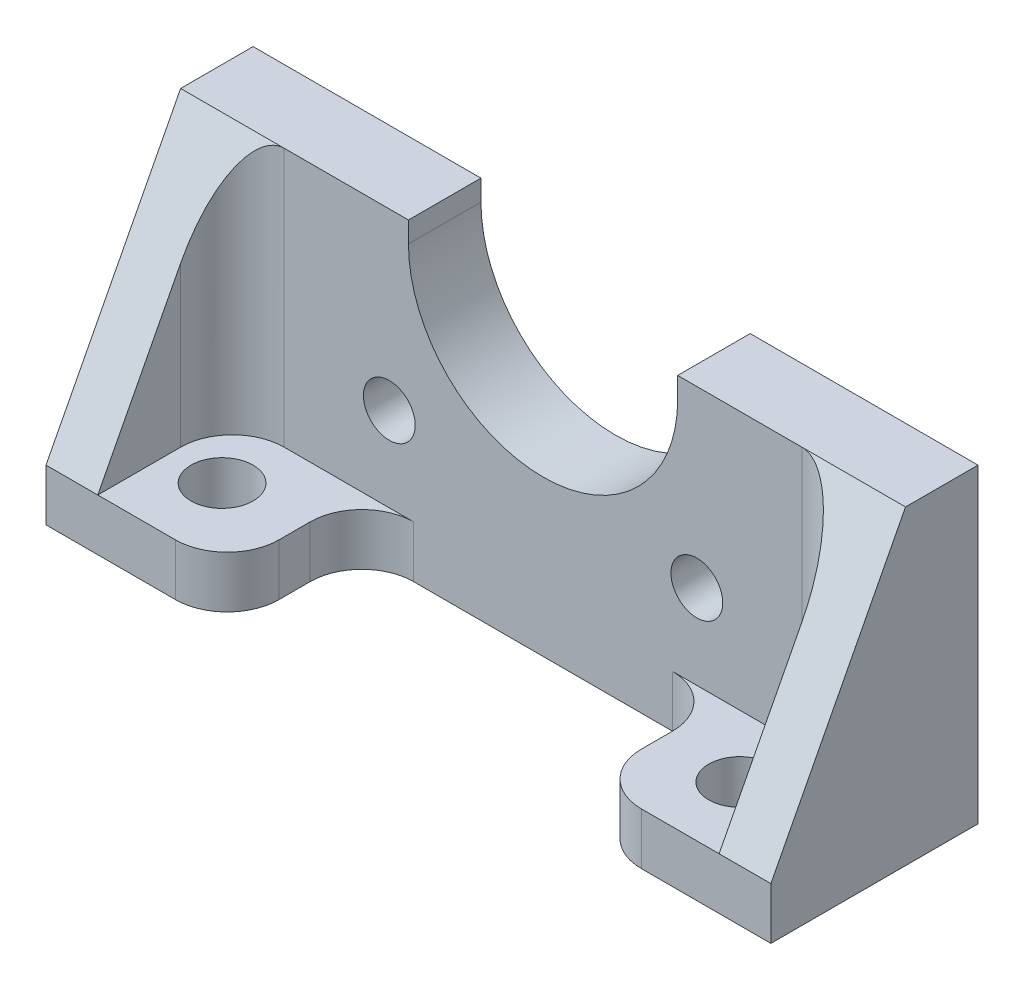
ISO-10303-21;
HEADER;
FILE_DESCRIPTION(('STEP AP214'),'2;1');
FILE_NAME('part.step','',(''),(''),'','','');
FILE_SCHEMA(('AUTOMOTIVE_DESIGN { 1 0 10303 214 1 1 1 1 }'));
ENDSEC;
DATA;
#1=APPLICATION_CONTEXT('core data for automotive mechanical design processes');
#2=APPLICATION_PROTOCOL_DEFINITION('international standard','automotive_design',2000,#1);
#3=PRODUCT_CONTEXT('',#1,'mechanical');
#4=PRODUCT('Part','Part','',(#3));
#5=PRODUCT_RELATED_PRODUCT_CATEGORY('part','',(#4));
#6=PRODUCT_DEFINITION_FORMATION('','',#4);
#7=PRODUCT_DEFINITION_CONTEXT('part definition',#1,'design');
#8=PRODUCT_DEFINITION('design','',#6,#7);
#9=PRODUCT_DEFINITION_SHAPE('','',#8);
#10=(LENGTH_UNIT() NAMED_UNIT(*) SI_UNIT(.MILLI.,.METRE.));
#11=(NAMED_UNIT(*) PLANE_ANGLE_UNIT() SI_UNIT($,.RADIAN.));
#12=(NAMED_UNIT(*) SI_UNIT($,.STERADIAN.) SOLID_ANGLE_UNIT());
#13=UNCERTAINTY_MEASURE_WITH_UNIT(LENGTH_MEASURE(1.E-05),#10,'distance_accuracy_value','');
#14=(GEOMETRIC_REPRESENTATION_CONTEXT(3) GLOBAL_UNCERTAINTY_ASSIGNED_CONTEXT((#13)) GLOBAL_UNIT_ASSIGNED_CONTEXT((#10,
#11,#12)) REPRESENTATION_CONTEXT('',''));
#15=CARTESIAN_POINT('',(0.,0.,0.));
#16=DIRECTION('',(0.,0.,1.));
#17=DIRECTION('',(1.,0.,0.));
#18=AXIS2_PLACEMENT_3D('',#15,#16,#17);
#19=CARTESIAN_POINT('',(35.,28.,20.));
#20=DIRECTION('',(0.,0.,1.));
#21=DIRECTION('',(1.,0.,0.));
#22=AXIS2_PLACEMENT_3D('',#19,#20,#21);
#23=PLANE('',#22);
#24=DIRECTION('',(1.,0.,0.));
#25=VECTOR('',#24,1.);
#26=CARTESIAN_POINT('',(70.,0.,20.));
#27=LINE('',#26,#25);
#28=CARTESIAN_POINT('',(0.,0.,20.));
#29=VERTEX_POINT('',#28);
#30=CARTESIAN_POINT('',(12.5,0.,20.));
#31=VERTEX_POINT('',#30);
#32=EDGE_CURVE('E400',#29,#31,#27,.T.);
#33=ORIENTED_EDGE('',*,*,#32,.T.);
#34=DIRECTION('',(0.,-1.,0.));
#35=VECTOR('',#34,1.);
#36=CARTESIAN_POINT('',(12.5,5.,20.));
#37=LINE('',#36,#35);
#38=CARTESIAN_POINT('',(12.5,5.,20.));
#39=VERTEX_POINT('',#38);
#40=EDGE_CURVE('E41',#31,#39,#37,.F.);
#41=ORIENTED_EDGE('',*,*,#40,.T.);
#42=DIRECTION('',(-1.,0.,0.));
#43=VECTOR('',#42,1.);
#44=CARTESIAN_POINT('',(65.,5.,20.));
#45=LINE('',#44,#43);
#46=CARTESIAN_POINT('',(5.,5.,20.));
#47=VERTEX_POINT('',#46);
#48=EDGE_CURVE('E317',#39,#47,#45,.T.);
#49=ORIENTED_EDGE('',*,*,#48,.T.);
#50=DIRECTION('',(1.,0.,0.));
#51=VECTOR('',#50,1.);
#52=CARTESIAN_POINT('',(0.,5.,20.));
#53=LINE('',#52,#51);
#54=CARTESIAN_POINT('',(0.,5.,20.));
#55=VERTEX_POINT('',#54);
#56=EDGE_CURVE('E229',#55,#47,#53,.T.);
#57=ORIENTED_EDGE('',*,*,#56,.F.);
#58=DIRECTION('',(0.,-1.,0.));
#59=VECTOR('',#58,1.);
#60=CARTESIAN_POINT('',(0.,5.,20.));
#61=LINE('',#60,#59);
#62=EDGE_CURVE('E401',#55,#29,#61,.T.);
#63=ORIENTED_EDGE('',*,*,#62,.T.);
#64=EDGE_LOOP('',(#33,#41,#49,#57,#63));
#65=FACE_BOUND('',#64,.T.);
#66=ADVANCED_FACE('F33',(#65),#23,.T.);
#67=CARTESIAN_POINT('',(0.,30.,7.));
#68=DIRECTION('',(0.,-0.461352736641989,-0.887216801234595));
#69=DIRECTION('',(0.,0.887216801234595,-0.461352736641989));
#70=AXIS2_PLACEMENT_3D('',#67,#68,#69);
#71=PLANE('',#70);
#72=CARTESIAN_POINT('',(60.,20.3846153846154,12.));
#73=DIRECTION('',(0.,-0.461352736641989,-0.887216801234595));
#74=DIRECTION('',(0.,-0.887216801234595,0.461352736641989));
#75=AXIS2_PLACEMENT_3D('',#72,#73,#74);
#76=ELLIPSE('',#75,10.8376944643118,5.);
#77=CARTESIAN_POINT('',(60.,30.,7.));
#78=VERTEX_POINT('',#77);
#79=CARTESIAN_POINT('',(65.,20.3846153846154,12.));
#80=VERTEX_POINT('',#79);
#81=EDGE_CURVE('E280',#78,#80,#76,.T.);
#82=ORIENTED_EDGE('',*,*,#81,.T.);
#83=DIRECTION('',(0.,-0.887216801234595,0.461352736641989));
#84=VECTOR('',#83,1.);
#85=CARTESIAN_POINT('',(65.,30.,7.));
#86=LINE('',#85,#84);
#87=CARTESIAN_POINT('',(65.,5.,20.));
#88=VERTEX_POINT('',#87);
#89=EDGE_CURVE('E213',#80,#88,#86,.T.);
#90=ORIENTED_EDGE('',*,*,#89,.T.);
#91=CARTESIAN_POINT('',(70.,5.,20.));
#92=VERTEX_POINT('',#91);
#93=EDGE_CURVE('E234',#88,#92,#53,.T.);
#94=ORIENTED_EDGE('',*,*,#93,.T.);
#95=DIRECTION('',(0.,0.887216801234595,-0.461352736641989));
#96=VECTOR('',#95,1.);
#97=CARTESIAN_POINT('',(70.,30.,7.));
#98=LINE('',#97,#96);
#99=CARTESIAN_POINT('',(70.,30.,7.));
#100=VERTEX_POINT('',#99);
#101=EDGE_CURVE('E241',#92,#100,#98,.T.);
#102=ORIENTED_EDGE('',*,*,#101,.T.);
#103=DIRECTION('',(1.,0.,0.));
#104=VECTOR('',#103,1.);
#105=CARTESIAN_POINT('',(0.,30.,7.));
#106=LINE('',#105,#104);
#107=EDGE_CURVE('E222',#78,#100,#106,.T.);
#108=ORIENTED_EDGE('',*,*,#107,.F.);
#109=EDGE_LOOP('',(#82,#90,#94,#102,#108));
#110=FACE_BOUND('',#109,.T.);
#111=ADVANCED_FACE('F354',(#110),#71,.F.);
#112=CARTESIAN_POINT('',(57.5,5.,20.));
#113=VERTEX_POINT('',#112);
#114=EDGE_CURVE('E233',#113,#88,#53,.T.);
#115=ORIENTED_EDGE('',*,*,#114,.F.);
#116=DIRECTION('',(0.,-1.,0.));
#117=VECTOR('',#116,1.);
#118=CARTESIAN_POINT('',(57.5,0.,20.));
#119=LINE('',#118,#117);
#120=CARTESIAN_POINT('',(57.5,0.,20.));
#121=VERTEX_POINT('',#120);
#122=EDGE_CURVE('E381',#113,#121,#119,.T.);
#123=ORIENTED_EDGE('',*,*,#122,.T.);
#124=CARTESIAN_POINT('',(70.,0.,20.));
#125=VERTEX_POINT('',#124);
#126=EDGE_CURVE('E404',#121,#125,#27,.T.);
#127=ORIENTED_EDGE('',*,*,#126,.T.);
#128=DIRECTION('',(0.,1.,0.));
#129=VECTOR('',#128,1.);
#130=CARTESIAN_POINT('',(70.,5.,20.));
#131=LINE('',#130,#129);
#132=EDGE_CURVE('E403',#125,#92,#131,.T.);
#133=ORIENTED_EDGE('',*,*,#132,.T.);
#134=ORIENTED_EDGE('',*,*,#93,.F.);
#135=EDGE_LOOP('',(#115,#123,#127,#133,#134));
#136=FACE_BOUND('',#135,.T.);
#137=ADVANCED_FACE('F414',(#136),#23,.T.);
#138=CARTESIAN_POINT('',(35.,28.,0.));
#139=DIRECTION('',(0.,0.,1.));
#140=DIRECTION('',(1.,0.,0.));
#141=AXIS2_PLACEMENT_3D('',#138,#139,#140);
#142=PLANE('',#141);
#143=CARTESIAN_POINT('',(20.1507575950825,13.1507575950825,0.));
#144=DIRECTION('',(0.,0.,1.));
#145=DIRECTION('',(1.,0.,0.));
#146=AXIS2_PLACEMENT_3D('',#143,#144,#145);
#147=CIRCLE('',#146,2.5);
#148=CARTESIAN_POINT('',(22.6507575950825,13.1507575950825,0.));
#149=VERTEX_POINT('',#148);
#150=EDGE_CURVE('E224',#149,#149,#147,.T.);
#151=ORIENTED_EDGE('',*,*,#150,.T.);
#152=EDGE_LOOP('',(#151));
#153=FACE_BOUND('',#152,.T.);
#154=DIRECTION('',(1.,0.,0.));
#155=VECTOR('',#154,1.);
#156=CARTESIAN_POINT('',(70.,0.,0.));
#157=LINE('',#156,#155);
#158=CARTESIAN_POINT('',(0.,0.,0.));
#159=VERTEX_POINT('',#158);
#160=CARTESIAN_POINT('',(70.,0.,0.));
#161=VERTEX_POINT('',#160);
#162=EDGE_CURVE('E474',#159,#161,#157,.T.);
#163=ORIENTED_EDGE('',*,*,#162,.F.);
#164=DIRECTION('',(0.,-1.,0.));
#165=VECTOR('',#164,1.);
#166=CARTESIAN_POINT('',(0.,0.,0.));
#167=LINE('',#166,#165);
#168=CARTESIAN_POINT('',(0.,30.,0.));
#169=VERTEX_POINT('',#168);
#170=EDGE_CURVE('E496',#169,#159,#167,.T.);
#171=ORIENTED_EDGE('',*,*,#170,.F.);
#172=DIRECTION('',(-1.,0.,0.));
#173=VECTOR('',#172,1.);
#174=CARTESIAN_POINT('',(0.,30.,0.));
#175=LINE('',#174,#173);
#176=CARTESIAN_POINT('',(22.,30.,0.));
#177=VERTEX_POINT('',#176);
#178=EDGE_CURVE('E494',#177,#169,#175,.T.);
#179=ORIENTED_EDGE('',*,*,#178,.F.);
#180=DIRECTION('',(0.,1.,0.));
#181=VECTOR('',#180,1.);
#182=CARTESIAN_POINT('',(22.,28.,0.));
#183=LINE('',#182,#181);
#184=CARTESIAN_POINT('',(22.,28.,0.));
#185=VERTEX_POINT('',#184);
#186=EDGE_CURVE('E491',#185,#177,#183,.T.);
#187=ORIENTED_EDGE('',*,*,#186,.F.);
#188=CARTESIAN_POINT('',(35.,28.,0.));
#189=DIRECTION('',(0.,0.,-1.));
#190=DIRECTION('',(1.,0.,0.));
#191=AXIS2_PLACEMENT_3D('',#188,#189,#190);
#192=CIRCLE('',#191,13.);
#193=CARTESIAN_POINT('',(48.,28.,0.));
#194=VERTEX_POINT('',#193);
#195=EDGE_CURVE('E488',#194,#185,#192,.T.);
#196=ORIENTED_EDGE('',*,*,#195,.F.);
#197=DIRECTION('',(0.,-1.,0.));
#198=VECTOR('',#197,1.);
#199=CARTESIAN_POINT('',(48.,28.,0.));
#200=LINE('',#199,#198);
#201=CARTESIAN_POINT('',(48.,30.,0.));
#202=VERTEX_POINT('',#201);
#203=EDGE_CURVE('E486',#202,#194,#200,.T.);
#204=ORIENTED_EDGE('',*,*,#203,.F.);
#205=DIRECTION('',(-1.,0.,0.));
#206=VECTOR('',#205,1.);
#207=CARTESIAN_POINT('',(48.,30.,0.));
#208=LINE('',#207,#206);
#209=CARTESIAN_POINT('',(70.,30.,0.));
#210=VERTEX_POINT('',#209);
#211=EDGE_CURVE('E361',#210,#202,#208,.T.);
#212=ORIENTED_EDGE('',*,*,#211,.F.);
#213=DIRECTION('',(0.,1.,0.));
#214=VECTOR('',#213,1.);
#215=CARTESIAN_POINT('',(70.,30.,0.));
#216=LINE('',#215,#214);
#217=EDGE_CURVE('E477',#161,#210,#216,.T.);
#218=ORIENTED_EDGE('',*,*,#217,.F.);
#219=EDGE_LOOP('',(#163,#171,#179,#187,#196,#204,#212,#218));
#220=FACE_BOUND('',#219,.T.);
#221=CARTESIAN_POINT('',(49.8492424049175,13.1507575950825,0.));
#222=DIRECTION('',(0.,0.,1.));
#223=DIRECTION('',(1.,0.,0.));
#224=AXIS2_PLACEMENT_3D('',#221,#222,#223);
#225=CIRCLE('',#224,2.5);
#226=CARTESIAN_POINT('',(52.3492424049175,13.1507575950825,0.));
#227=VERTEX_POINT('',#226);
#228=EDGE_CURVE('E219',#227,#227,#225,.T.);
#229=ORIENTED_EDGE('',*,*,#228,.T.);
#230=EDGE_LOOP('',(#229));
#231=FACE_BOUND('',#230,.T.);
#232=ADVANCED_FACE('F422',(#153,#220,#231),#142,.F.);
#233=CARTESIAN_POINT('',(70.,0.,20.));
#234=DIRECTION('',(0.,1.,0.));
#235=DIRECTION('',(0.,0.,1.));
#236=AXIS2_PLACEMENT_3D('',#233,#234,#235);
#237=PLANE('',#236);
#238=CARTESIAN_POINT('',(60.,0.,13.));
#239=DIRECTION('',(0.,-1.,0.));
#240=DIRECTION('',(0.,0.,-1.));
#241=AXIS2_PLACEMENT_3D('',#238,#239,#240);
#242=CIRCLE('',#241,3.00000000000001);
#243=CARTESIAN_POINT('',(60.,0.,9.99999999999999));
#244=VERTEX_POINT('',#243);
#245=EDGE_CURVE('E249',#244,#244,#242,.T.);
#246=ORIENTED_EDGE('',*,*,#245,.F.);
#247=EDGE_LOOP('',(#246));
#248=FACE_BOUND('',#247,.T.);
#249=CARTESIAN_POINT('',(10.,0.,13.));
#250=DIRECTION('',(0.,-1.,0.));
#251=DIRECTION('',(0.,0.,-1.));
#252=AXIS2_PLACEMENT_3D('',#249,#250,#251);
#253=CIRCLE('',#252,3.);
#254=CARTESIAN_POINT('',(10.,0.,10.));
#255=VERTEX_POINT('',#254);
#256=EDGE_CURVE('E245',#255,#255,#253,.T.);
#257=ORIENTED_EDGE('',*,*,#256,.F.);
#258=EDGE_LOOP('',(#257));
#259=FACE_BOUND('',#258,.T.);
#260=ORIENTED_EDGE('',*,*,#126,.F.);
#261=CARTESIAN_POINT('',(57.5,0.,15.));
#262=DIRECTION('',(0.,1.,0.));
#263=DIRECTION('',(0.,0.,1.));
#264=AXIS2_PLACEMENT_3D('',#261,#262,#263);
#265=CIRCLE('',#264,5.);
#266=CARTESIAN_POINT('',(52.5,0.,15.));
#267=VERTEX_POINT('',#266);
#268=EDGE_CURVE('E386',#121,#267,#265,.F.);
#269=ORIENTED_EDGE('',*,*,#268,.T.);
#270=DIRECTION('',(0.,0.,1.));
#271=VECTOR('',#270,1.);
#272=CARTESIAN_POINT('',(52.5,0.,20.));
#273=LINE('',#272,#271);
#274=CARTESIAN_POINT('',(52.5,0.,12.));
#275=VERTEX_POINT('',#274);
#276=EDGE_CURVE('E262',#275,#267,#273,.T.);
#277=ORIENTED_EDGE('',*,*,#276,.F.);
#278=CARTESIAN_POINT('',(47.5,0.,12.));
#279=DIRECTION('',(0.,-1.,0.));
#280=DIRECTION('',(0.,0.,-1.));
#281=AXIS2_PLACEMENT_3D('',#278,#279,#280);
#282=CIRCLE('',#281,5.);
#283=CARTESIAN_POINT('',(47.5,0.,7.));
#284=VERTEX_POINT('',#283);
#285=EDGE_CURVE('E269',#284,#275,#282,.T.);
#286=ORIENTED_EDGE('',*,*,#285,.F.);
#287=DIRECTION('',(1.,0.,0.));
#288=VECTOR('',#287,1.);
#289=CARTESIAN_POINT('',(22.5,0.,7.));
#290=LINE('',#289,#288);
#291=CARTESIAN_POINT('',(22.5,0.,7.));
#292=VERTEX_POINT('',#291);
#293=EDGE_CURVE('E272',#292,#284,#290,.T.);
#294=ORIENTED_EDGE('',*,*,#293,.F.);
#295=CARTESIAN_POINT('',(22.5,0.,12.));
#296=DIRECTION('',(0.,-1.,0.));
#297=DIRECTION('',(0.,0.,-1.));
#298=AXIS2_PLACEMENT_3D('',#295,#296,#297);
#299=CIRCLE('',#298,5.);
#300=CARTESIAN_POINT('',(17.5,0.,12.));
#301=VERTEX_POINT('',#300);
#302=EDGE_CURVE('E275',#301,#292,#299,.T.);
#303=ORIENTED_EDGE('',*,*,#302,.F.);
#304=DIRECTION('',(0.,0.,-1.));
#305=VECTOR('',#304,1.);
#306=CARTESIAN_POINT('',(17.5,0.,20.));
#307=LINE('',#306,#305);
#308=CARTESIAN_POINT('',(17.5,0.,15.));
#309=VERTEX_POINT('',#308);
#310=EDGE_CURVE('E278',#309,#301,#307,.T.);
#311=ORIENTED_EDGE('',*,*,#310,.F.);
#312=CARTESIAN_POINT('',(12.5,0.,15.));
#313=DIRECTION('',(0.,1.,0.));
#314=DIRECTION('',(0.,0.,1.));
#315=AXIS2_PLACEMENT_3D('',#312,#313,#314);
#316=CIRCLE('',#315,5.);
#317=EDGE_CURVE('E384',#309,#31,#316,.F.);
#318=ORIENTED_EDGE('',*,*,#317,.T.);
#319=ORIENTED_EDGE('',*,*,#32,.F.);
#320=DIRECTION('',(0.,0.,-1.));
#321=VECTOR('',#320,1.);
#322=CARTESIAN_POINT('',(0.,0.,20.));
#323=LINE('',#322,#321);
#324=EDGE_CURVE('E481',#29,#159,#323,.T.);
#325=ORIENTED_EDGE('',*,*,#324,.T.);
#326=ORIENTED_EDGE('',*,*,#162,.T.);
#327=DIRECTION('',(0.,0.,-1.));
#328=VECTOR('',#327,1.);
#329=CARTESIAN_POINT('',(70.,0.,20.));
#330=LINE('',#329,#328);
#331=EDGE_CURVE('E368',#125,#161,#330,.T.);
#332=ORIENTED_EDGE('',*,*,#331,.F.);
#333=EDGE_LOOP('',(#260,#269,#277,#286,#294,#303,#311,#318,#319,#325,#326,#332));
#334=FACE_BOUND('',#333,.T.);
#335=ADVANCED_FACE('F336',(#248,#259,#334),#237,.F.);
#336=CARTESIAN_POINT('',(70.,30.,20.));
#337=DIRECTION('',(-1.,0.,0.));
#338=DIRECTION('',(0.,0.,1.));
#339=AXIS2_PLACEMENT_3D('',#336,#337,#338);
#340=PLANE('',#339);
#341=DIRECTION('',(0.,0.,-1.));
#342=VECTOR('',#341,1.);
#343=CARTESIAN_POINT('',(70.,30.,20.));
#344=LINE('',#343,#342);
#345=EDGE_CURVE('E365',#100,#210,#344,.T.);
#346=ORIENTED_EDGE('',*,*,#345,.F.);
#347=ORIENTED_EDGE('',*,*,#101,.F.);
#348=ORIENTED_EDGE('',*,*,#132,.F.);
#349=ORIENTED_EDGE('',*,*,#331,.T.);
#350=ORIENTED_EDGE('',*,*,#217,.T.);
#351=EDGE_LOOP('',(#346,#347,#348,#349,#350));
#352=FACE_BOUND('',#351,.T.);
#353=ADVANCED_FACE('F516',(#352),#340,.F.);
#354=CARTESIAN_POINT('',(48.,30.,20.));
#355=DIRECTION('',(0.,-1.,0.));
#356=DIRECTION('',(0.,0.,-1.));
#357=AXIS2_PLACEMENT_3D('',#354,#355,#356);
#358=PLANE('',#357);
#359=DIRECTION('',(0.,0.,-1.));
#360=VECTOR('',#359,1.);
#361=CARTESIAN_POINT('',(48.,30.,20.));
#362=LINE('',#361,#360);
#363=CARTESIAN_POINT('',(48.,30.,7.));
#364=VERTEX_POINT('',#363);
#365=EDGE_CURVE('E359',#364,#202,#362,.T.);
#366=ORIENTED_EDGE('',*,*,#365,.F.);
#367=EDGE_CURVE('E220',#364,#78,#106,.T.);
#368=ORIENTED_EDGE('',*,*,#367,.T.);
#369=ORIENTED_EDGE('',*,*,#107,.T.);
#370=ORIENTED_EDGE('',*,*,#345,.T.);
#371=ORIENTED_EDGE('',*,*,#211,.T.);
#372=EDGE_LOOP('',(#366,#368,#369,#370,#371));
#373=FACE_BOUND('',#372,.T.);
#374=ADVANCED_FACE('F357',(#373),#358,.F.);
#375=CARTESIAN_POINT('',(48.,28.,20.));
#376=DIRECTION('',(1.,0.,0.));
#377=DIRECTION('',(0.,0.,-1.));
#378=AXIS2_PLACEMENT_3D('',#375,#376,#377);
#379=PLANE('',#378);
#380=DIRECTION('',(0.,0.,-1.));
#381=VECTOR('',#380,1.);
#382=CARTESIAN_POINT('',(48.,28.,20.));
#383=LINE('',#382,#381);
#384=CARTESIAN_POINT('',(48.,28.,7.));
#385=VERTEX_POINT('',#384);
#386=EDGE_CURVE('E366',#385,#194,#383,.T.);
#387=ORIENTED_EDGE('',*,*,#386,.F.);
#388=DIRECTION('',(0.,1.,0.));
#389=VECTOR('',#388,1.);
#390=CARTESIAN_POINT('',(48.,28.,7.));
#391=LINE('',#390,#389);
#392=EDGE_CURVE('E283',#385,#364,#391,.T.);
#393=ORIENTED_EDGE('',*,*,#392,.T.);
#394=ORIENTED_EDGE('',*,*,#365,.T.);
#395=ORIENTED_EDGE('',*,*,#203,.T.);
#396=EDGE_LOOP('',(#387,#393,#394,#395));
#397=FACE_BOUND('',#396,.T.);
#398=ADVANCED_FACE('F517',(#397),#379,.F.);
#399=CARTESIAN_POINT('',(35.,28.,20.));
#400=DIRECTION('',(0.,0.,-1.));
#401=DIRECTION('',(-1.,0.,0.));
#402=AXIS2_PLACEMENT_3D('',#399,#400,#401);
#403=CYLINDRICAL_SURFACE('',#402,13.);
#404=DIRECTION('',(0.,0.,-1.));
#405=VECTOR('',#404,1.);
#406=CARTESIAN_POINT('',(22.,28.,20.));
#407=LINE('',#406,#405);
#408=CARTESIAN_POINT('',(22.,28.,7.));
#409=VERTEX_POINT('',#408);
#410=EDGE_CURVE('E370',#409,#185,#407,.T.);
#411=ORIENTED_EDGE('',*,*,#410,.F.);
#412=CARTESIAN_POINT('',(35.,28.,7.));
#413=DIRECTION('',(0.,0.,-1.));
#414=DIRECTION('',(-1.,0.,0.));
#415=AXIS2_PLACEMENT_3D('',#412,#413,#414);
#416=CIRCLE('',#415,13.);
#417=EDGE_CURVE('E252',#409,#385,#416,.F.);
#418=ORIENTED_EDGE('',*,*,#417,.T.);
#419=ORIENTED_EDGE('',*,*,#386,.T.);
#420=ORIENTED_EDGE('',*,*,#195,.T.);
#421=EDGE_LOOP('',(#411,#418,#419,#420));
#422=FACE_BOUND('',#421,.T.);
#423=ADVANCED_FACE('F508',(#422),#403,.F.);
#424=CARTESIAN_POINT('',(22.,28.,20.));
#425=DIRECTION('',(-1.,0.,0.));
#426=DIRECTION('',(0.,-1.,0.));
#427=AXIS2_PLACEMENT_3D('',#424,#425,#426);
#428=PLANE('',#427);
#429=DIRECTION('',(0.,0.,-1.));
#430=VECTOR('',#429,1.);
#431=CARTESIAN_POINT('',(22.,30.,20.));
#432=LINE('',#431,#430);
#433=CARTESIAN_POINT('',(22.,30.,7.));
#434=VERTEX_POINT('',#433);
#435=EDGE_CURVE('E500',#434,#177,#432,.T.);
#436=ORIENTED_EDGE('',*,*,#435,.F.);
#437=DIRECTION('',(0.,-1.,0.));
#438=VECTOR('',#437,1.);
#439=CARTESIAN_POINT('',(22.,28.,7.));
#440=LINE('',#439,#438);
#441=EDGE_CURVE('E199',#434,#409,#440,.T.);
#442=ORIENTED_EDGE('',*,*,#441,.T.);
#443=ORIENTED_EDGE('',*,*,#410,.T.);
#444=ORIENTED_EDGE('',*,*,#186,.T.);
#445=EDGE_LOOP('',(#436,#442,#443,#444));
#446=FACE_BOUND('',#445,.T.);
#447=ADVANCED_FACE('F503',(#446),#428,.F.);
#448=CARTESIAN_POINT('',(0.,30.,20.));
#449=DIRECTION('',(0.,-1.,0.));
#450=DIRECTION('',(0.,0.,-1.));
#451=AXIS2_PLACEMENT_3D('',#448,#449,#450);
#452=PLANE('',#451);
#453=DIRECTION('',(0.,0.,-1.));
#454=VECTOR('',#453,1.);
#455=CARTESIAN_POINT('',(0.,30.,20.));
#456=LINE('',#455,#454);
#457=CARTESIAN_POINT('',(0.,30.,7.));
#458=VERTEX_POINT('',#457);
#459=EDGE_CURVE('E218',#458,#169,#456,.T.);
#460=ORIENTED_EDGE('',*,*,#459,.F.);
#461=CARTESIAN_POINT('',(10.,30.,7.));
#462=VERTEX_POINT('',#461);
#463=EDGE_CURVE('E208',#458,#462,#106,.T.);
#464=ORIENTED_EDGE('',*,*,#463,.T.);
#465=DIRECTION('',(1.,0.,0.));
#466=VECTOR('',#465,1.);
#467=CARTESIAN_POINT('',(10.,30.,7.));
#468=LINE('',#467,#466);
#469=EDGE_CURVE('E194',#462,#434,#468,.T.);
#470=ORIENTED_EDGE('',*,*,#469,.T.);
#471=ORIENTED_EDGE('',*,*,#435,.T.);
#472=ORIENTED_EDGE('',*,*,#178,.T.);
#473=EDGE_LOOP('',(#460,#464,#470,#471,#472));
#474=FACE_BOUND('',#473,.T.);
#475=ADVANCED_FACE('F216',(#474),#452,.F.);
#476=CARTESIAN_POINT('',(0.,0.,20.));
#477=DIRECTION('',(1.,0.,0.));
#478=DIRECTION('',(0.,0.,-1.));
#479=AXIS2_PLACEMENT_3D('',#476,#477,#478);
#480=PLANE('',#479);
#481=ORIENTED_EDGE('',*,*,#62,.F.);
#482=DIRECTION('',(0.,0.887216801234595,-0.461352736641989));
#483=VECTOR('',#482,1.);
#484=CARTESIAN_POINT('',(0.,30.,7.));
#485=LINE('',#484,#483);
#486=EDGE_CURVE('E236',#55,#458,#485,.T.);
#487=ORIENTED_EDGE('',*,*,#486,.T.);
#488=ORIENTED_EDGE('',*,*,#459,.T.);
#489=ORIENTED_EDGE('',*,*,#170,.T.);
#490=ORIENTED_EDGE('',*,*,#324,.F.);
#491=EDGE_LOOP('',(#481,#487,#488,#489,#490));
#492=FACE_BOUND('',#491,.T.);
#493=ADVANCED_FACE('F464',(#492),#480,.F.);
#494=CARTESIAN_POINT('',(20.1507575950825,13.1507575950825,20.));
#495=DIRECTION('',(0.,0.,-1.));
#496=DIRECTION('',(-1.,0.,0.));
#497=AXIS2_PLACEMENT_3D('',#494,#495,#496);
#498=CYLINDRICAL_SURFACE('',#497,2.5);
#499=CARTESIAN_POINT('',(20.1507575950825,13.1507575950825,7.));
#500=DIRECTION('',(0.,0.,-1.));
#501=DIRECTION('',(-1.,0.,0.));
#502=AXIS2_PLACEMENT_3D('',#499,#500,#501);
#503=CIRCLE('',#502,2.5);
#504=CARTESIAN_POINT('',(17.6507575950825,13.1507575950825,7.));
#505=VERTEX_POINT('',#504);
#506=EDGE_CURVE('E254',#505,#505,#503,.T.);
#507=ORIENTED_EDGE('',*,*,#506,.F.);
#508=EDGE_LOOP('',(#507));
#509=FACE_BOUND('',#508,.T.);
#510=ORIENTED_EDGE('',*,*,#150,.F.);
#511=EDGE_LOOP('',(#510));
#512=FACE_BOUND('',#511,.T.);
#513=ADVANCED_FACE('F461',(#509,#512),#498,.F.);
#514=CARTESIAN_POINT('',(49.8492424049175,13.1507575950825,20.));
#515=DIRECTION('',(0.,0.,-1.));
#516=DIRECTION('',(-1.,0.,0.));
#517=AXIS2_PLACEMENT_3D('',#514,#515,#516);
#518=CYLINDRICAL_SURFACE('',#517,2.5);
#519=CARTESIAN_POINT('',(49.8492424049175,13.1507575950825,7.));
#520=DIRECTION('',(0.,0.,-1.));
#521=DIRECTION('',(-1.,0.,0.));
#522=AXIS2_PLACEMENT_3D('',#519,#520,#521);
#523=CIRCLE('',#522,2.5);
#524=CARTESIAN_POINT('',(47.3492424049175,13.1507575950825,7.));
#525=VERTEX_POINT('',#524);
#526=EDGE_CURVE('E376',#525,#525,#523,.T.);
#527=ORIENTED_EDGE('',*,*,#526,.F.);
#528=EDGE_LOOP('',(#527));
#529=FACE_BOUND('',#528,.T.);
#530=ORIENTED_EDGE('',*,*,#228,.F.);
#531=EDGE_LOOP('',(#530));
#532=FACE_BOUND('',#531,.T.);
#533=ADVANCED_FACE('F459',(#529,#532),#518,.F.);
#534=DIRECTION('',(0.,0.887216801234595,-0.461352736641989));
#535=VECTOR('',#534,1.);
#536=CARTESIAN_POINT('',(5.,30.,7.));
#537=LINE('',#536,#535);
#538=CARTESIAN_POINT('',(5.,20.3846153846154,12.));
#539=VERTEX_POINT('',#538);
#540=EDGE_CURVE('E212',#47,#539,#537,.T.);
#541=ORIENTED_EDGE('',*,*,#540,.T.);
#542=CARTESIAN_POINT('',(10.,20.3846153846154,12.));
#543=DIRECTION('',(0.,-0.461352736641989,-0.887216801234595));
#544=DIRECTION('',(0.,-0.887216801234595,0.461352736641989));
#545=AXIS2_PLACEMENT_3D('',#542,#543,#544);
#546=ELLIPSE('',#545,10.8376944643118,5.);
#547=EDGE_CURVE('E183',#539,#462,#546,.T.);
#548=ORIENTED_EDGE('',*,*,#547,.T.);
#549=ORIENTED_EDGE('',*,*,#463,.F.);
#550=ORIENTED_EDGE('',*,*,#486,.F.);
#551=ORIENTED_EDGE('',*,*,#56,.T.);
#552=EDGE_LOOP('',(#541,#548,#549,#550,#551));
#553=FACE_BOUND('',#552,.T.);
#554=ADVANCED_FACE('F207',(#553),#71,.F.);
#555=CARTESIAN_POINT('',(10.,30.,13.));
#556=DIRECTION('',(0.,-1.,0.));
#557=DIRECTION('',(0.,0.,-1.));
#558=AXIS2_PLACEMENT_3D('',#555,#556,#557);
#559=CYLINDRICAL_SURFACE('',#558,3.);
#560=CARTESIAN_POINT('',(10.,5.,13.));
#561=DIRECTION('',(0.,-1.,0.));
#562=DIRECTION('',(0.,0.,-1.));
#563=AXIS2_PLACEMENT_3D('',#560,#561,#562);
#564=CIRCLE('',#563,3.);
#565=CARTESIAN_POINT('',(10.,5.,10.));
#566=VERTEX_POINT('',#565);
#567=EDGE_CURVE('E287',#566,#566,#564,.F.);
#568=ORIENTED_EDGE('',*,*,#567,.T.);
#569=EDGE_LOOP('',(#568));
#570=FACE_BOUND('',#569,.T.);
#571=ORIENTED_EDGE('',*,*,#256,.T.);
#572=EDGE_LOOP('',(#571));
#573=FACE_BOUND('',#572,.T.);
#574=ADVANCED_FACE('F453',(#570,#573),#559,.F.);
#575=CARTESIAN_POINT('',(60.,30.,13.));
#576=DIRECTION('',(0.,-1.,0.));
#577=DIRECTION('',(0.,0.,-1.));
#578=AXIS2_PLACEMENT_3D('',#575,#576,#577);
#579=CYLINDRICAL_SURFACE('',#578,3.00000000000001);
#580=CARTESIAN_POINT('',(60.,5.,13.));
#581=DIRECTION('',(0.,-1.,0.));
#582=DIRECTION('',(0.,0.,-1.));
#583=AXIS2_PLACEMENT_3D('',#580,#581,#582);
#584=CIRCLE('',#583,3.00000000000001);
#585=CARTESIAN_POINT('',(60.,5.,9.99999999999999));
#586=VERTEX_POINT('',#585);
#587=EDGE_CURVE('E290',#586,#586,#584,.F.);
#588=ORIENTED_EDGE('',*,*,#587,.T.);
#589=EDGE_LOOP('',(#588));
#590=FACE_BOUND('',#589,.T.);
#591=ORIENTED_EDGE('',*,*,#245,.T.);
#592=EDGE_LOOP('',(#591));
#593=FACE_BOUND('',#592,.T.);
#594=ADVANCED_FACE('F448',(#590,#593),#579,.F.);
#595=CARTESIAN_POINT('',(22.5,30.,7.));
#596=DIRECTION('',(0.,0.,-1.));
#597=DIRECTION('',(-1.,0.,0.));
#598=AXIS2_PLACEMENT_3D('',#595,#596,#597);
#599=PLANE('',#598);
#600=DIRECTION('',(0.,-1.,0.));
#601=VECTOR('',#600,1.);
#602=CARTESIAN_POINT('',(47.5,30.,7.));
#603=LINE('',#602,#601);
#604=CARTESIAN_POINT('',(47.5,5.00000000000001,7.));
#605=VERTEX_POINT('',#604);
#606=EDGE_CURVE('E264',#605,#284,#603,.T.);
#607=ORIENTED_EDGE('',*,*,#606,.F.);
#608=DIRECTION('',(1.,0.,0.));
#609=VECTOR('',#608,1.);
#610=CARTESIAN_POINT('',(10.,5.,7.));
#611=LINE('',#610,#609);
#612=CARTESIAN_POINT('',(60.,5.,7.));
#613=VERTEX_POINT('',#612);
#614=EDGE_CURVE('E312',#605,#613,#611,.T.);
#615=ORIENTED_EDGE('',*,*,#614,.T.);
#616=DIRECTION('',(0.,-1.,0.));
#617=VECTOR('',#616,1.);
#618=CARTESIAN_POINT('',(60.,30.,7.));
#619=LINE('',#618,#617);
#620=EDGE_CURVE('E190',#78,#613,#619,.T.);
#621=ORIENTED_EDGE('',*,*,#620,.F.);
#622=ORIENTED_EDGE('',*,*,#367,.F.);
#623=ORIENTED_EDGE('',*,*,#392,.F.);
#624=ORIENTED_EDGE('',*,*,#417,.F.);
#625=ORIENTED_EDGE('',*,*,#441,.F.);
#626=ORIENTED_EDGE('',*,*,#469,.F.);
#627=DIRECTION('',(0.,-1.,0.));
#628=VECTOR('',#627,1.);
#629=CARTESIAN_POINT('',(10.,30.,7.));
#630=LINE('',#629,#628);
#631=CARTESIAN_POINT('',(10.,5.,7.));
#632=VERTEX_POINT('',#631);
#633=EDGE_CURVE('E179',#462,#632,#630,.T.);
#634=ORIENTED_EDGE('',*,*,#633,.T.);
#635=CARTESIAN_POINT('',(22.5,5.,7.));
#636=VERTEX_POINT('',#635);
#637=EDGE_CURVE('E310',#632,#636,#611,.T.);
#638=ORIENTED_EDGE('',*,*,#637,.T.);
#639=DIRECTION('',(0.,-1.,0.));
#640=VECTOR('',#639,1.);
#641=CARTESIAN_POINT('',(22.5,30.,7.));
#642=LINE('',#641,#640);
#643=EDGE_CURVE('E261',#636,#292,#642,.T.);
#644=ORIENTED_EDGE('',*,*,#643,.T.);
#645=ORIENTED_EDGE('',*,*,#293,.T.);
#646=EDGE_LOOP('',(#607,#615,#621,#622,#623,#624,#625,#626,#634,#638,#644,#645));
#647=FACE_BOUND('',#646,.T.);
#648=ORIENTED_EDGE('',*,*,#526,.T.);
#649=EDGE_LOOP('',(#648));
#650=FACE_BOUND('',#649,.T.);
#651=ORIENTED_EDGE('',*,*,#506,.T.);
#652=EDGE_LOOP('',(#651));
#653=FACE_BOUND('',#652,.T.);
#654=ADVANCED_FACE('F196',(#647,#650,#653),#599,.F.);
#655=CARTESIAN_POINT('',(17.5,30.,20.));
#656=DIRECTION('',(-1.,0.,0.));
#657=DIRECTION('',(0.,0.,1.));
#658=AXIS2_PLACEMENT_3D('',#655,#656,#657);
#659=PLANE('',#658);
#660=DIRECTION('',(0.,0.,1.));
#661=VECTOR('',#660,1.);
#662=CARTESIAN_POINT('',(17.5,5.,20.));
#663=LINE('',#662,#661);
#664=CARTESIAN_POINT('',(17.5,5.00000000000001,12.));
#665=VERTEX_POINT('',#664);
#666=CARTESIAN_POINT('',(17.5,5.,15.));
#667=VERTEX_POINT('',#666);
#668=EDGE_CURVE('E298',#665,#667,#663,.T.);
#669=ORIENTED_EDGE('',*,*,#668,.T.);
#670=DIRECTION('',(0.,-1.,0.));
#671=VECTOR('',#670,1.);
#672=CARTESIAN_POINT('',(17.5,0.,15.));
#673=LINE('',#672,#671);
#674=EDGE_CURVE('E392',#667,#309,#673,.T.);
#675=ORIENTED_EDGE('',*,*,#674,.T.);
#676=ORIENTED_EDGE('',*,*,#310,.T.);
#677=DIRECTION('',(0.,-1.,0.));
#678=VECTOR('',#677,1.);
#679=CARTESIAN_POINT('',(17.5,30.,12.));
#680=LINE('',#679,#678);
#681=EDGE_CURVE('E258',#665,#301,#680,.T.);
#682=ORIENTED_EDGE('',*,*,#681,.F.);
#683=EDGE_LOOP('',(#669,#675,#676,#682));
#684=FACE_BOUND('',#683,.T.);
#685=ADVANCED_FACE('F396',(#684),#659,.F.);
#686=CARTESIAN_POINT('',(52.5,30.,20.));
#687=DIRECTION('',(1.,0.,0.));
#688=DIRECTION('',(0.,0.,-1.));
#689=AXIS2_PLACEMENT_3D('',#686,#687,#688);
#690=PLANE('',#689);
#691=ORIENTED_EDGE('',*,*,#276,.T.);
#692=DIRECTION('',(0.,-1.,0.));
#693=VECTOR('',#692,1.);
#694=CARTESIAN_POINT('',(52.5,5.,15.));
#695=LINE('',#694,#693);
#696=CARTESIAN_POINT('',(52.5,5.,15.));
#697=VERTEX_POINT('',#696);
#698=EDGE_CURVE('E388',#267,#697,#695,.F.);
#699=ORIENTED_EDGE('',*,*,#698,.T.);
#700=DIRECTION('',(0.,0.,-1.));
#701=VECTOR('',#700,1.);
#702=CARTESIAN_POINT('',(52.5,5.,20.));
#703=LINE('',#702,#701);
#704=CARTESIAN_POINT('',(52.5,5.,12.));
#705=VERTEX_POINT('',#704);
#706=EDGE_CURVE('E293',#697,#705,#703,.T.);
#707=ORIENTED_EDGE('',*,*,#706,.T.);
#708=DIRECTION('',(0.,-1.,0.));
#709=VECTOR('',#708,1.);
#710=CARTESIAN_POINT('',(52.5,30.,12.));
#711=LINE('',#710,#709);
#712=EDGE_CURVE('E257',#705,#275,#711,.T.);
#713=ORIENTED_EDGE('',*,*,#712,.T.);
#714=EDGE_LOOP('',(#691,#699,#707,#713));
#715=FACE_BOUND('',#714,.T.);
#716=ADVANCED_FACE('F434',(#715),#690,.F.);
#717=CARTESIAN_POINT('',(47.5,30.,12.));
#718=DIRECTION('',(0.,-1.,0.));
#719=DIRECTION('',(0.,0.,-1.));
#720=AXIS2_PLACEMENT_3D('',#717,#718,#719);
#721=CYLINDRICAL_SURFACE('',#720,5.);
#722=ORIENTED_EDGE('',*,*,#712,.F.);
#723=CARTESIAN_POINT('',(47.5,5.,12.));
#724=DIRECTION('',(0.,-1.,0.));
#725=DIRECTION('',(0.,0.,-1.));
#726=AXIS2_PLACEMENT_3D('',#723,#724,#725);
#727=CIRCLE('',#726,5.);
#728=EDGE_CURVE('E295',#705,#605,#727,.F.);
#729=ORIENTED_EDGE('',*,*,#728,.T.);
#730=ORIENTED_EDGE('',*,*,#606,.T.);
#731=ORIENTED_EDGE('',*,*,#285,.T.);
#732=EDGE_LOOP('',(#722,#729,#730,#731));
#733=FACE_BOUND('',#732,.T.);
#734=ADVANCED_FACE('F341',(#733),#721,.F.);
#735=CARTESIAN_POINT('',(22.5,30.,12.));
#736=DIRECTION('',(0.,-1.,0.));
#737=DIRECTION('',(0.,0.,-1.));
#738=AXIS2_PLACEMENT_3D('',#735,#736,#737);
#739=CYLINDRICAL_SURFACE('',#738,5.);
#740=ORIENTED_EDGE('',*,*,#643,.F.);
#741=CARTESIAN_POINT('',(22.5,5.,12.));
#742=DIRECTION('',(0.,-1.,0.));
#743=DIRECTION('',(0.,0.,-1.));
#744=AXIS2_PLACEMENT_3D('',#741,#742,#743);
#745=CIRCLE('',#744,5.);
#746=EDGE_CURVE('E321',#636,#665,#745,.F.);
#747=ORIENTED_EDGE('',*,*,#746,.T.);
#748=ORIENTED_EDGE('',*,*,#681,.T.);
#749=ORIENTED_EDGE('',*,*,#302,.T.);
#750=EDGE_LOOP('',(#740,#747,#748,#749));
#751=FACE_BOUND('',#750,.T.);
#752=ADVANCED_FACE('F328',(#751),#739,.F.);
#753=CARTESIAN_POINT('',(10.,5.,12.));
#754=DIRECTION('',(0.,-1.,0.));
#755=DIRECTION('',(0.,0.,-1.));
#756=AXIS2_PLACEMENT_3D('',#753,#754,#755);
#757=PLANE('',#756);
#758=ORIENTED_EDGE('',*,*,#48,.F.);
#759=CARTESIAN_POINT('',(12.5,5.,15.));
#760=DIRECTION('',(0.,-1.,0.));
#761=DIRECTION('',(0.,0.,-1.));
#762=AXIS2_PLACEMENT_3D('',#759,#760,#761);
#763=CIRCLE('',#762,5.);
#764=EDGE_CURVE('E11',#39,#667,#763,.F.);
#765=ORIENTED_EDGE('',*,*,#764,.T.);
#766=ORIENTED_EDGE('',*,*,#668,.F.);
#767=ORIENTED_EDGE('',*,*,#746,.F.);
#768=ORIENTED_EDGE('',*,*,#637,.F.);
#769=CARTESIAN_POINT('',(10.,5.,12.));
#770=DIRECTION('',(0.,-1.,0.));
#771=DIRECTION('',(0.,0.,-1.));
#772=AXIS2_PLACEMENT_3D('',#769,#770,#771);
#773=CIRCLE('',#772,5.);
#774=CARTESIAN_POINT('',(5.,5.,12.));
#775=VERTEX_POINT('',#774);
#776=EDGE_CURVE('E186',#775,#632,#773,.T.);
#777=ORIENTED_EDGE('',*,*,#776,.F.);
#778=DIRECTION('',(0.,0.,-1.));
#779=VECTOR('',#778,1.);
#780=CARTESIAN_POINT('',(5.,5.,20.));
#781=LINE('',#780,#779);
#782=EDGE_CURVE('E314',#47,#775,#781,.T.);
#783=ORIENTED_EDGE('',*,*,#782,.F.);
#784=EDGE_LOOP('',(#758,#765,#766,#767,#768,#777,#783));
#785=FACE_BOUND('',#784,.T.);
#786=ORIENTED_EDGE('',*,*,#567,.F.);
#787=EDGE_LOOP('',(#786));
#788=FACE_BOUND('',#787,.T.);
#789=ADVANCED_FACE('F323',(#785,#788),#757,.F.);
#790=CARTESIAN_POINT('',(5.,30.,20.));
#791=DIRECTION('',(-1.,0.,0.));
#792=DIRECTION('',(0.,0.,1.));
#793=AXIS2_PLACEMENT_3D('',#790,#791,#792);
#794=PLANE('',#793);
#795=ORIENTED_EDGE('',*,*,#782,.T.);
#796=DIRECTION('',(0.,-1.,0.));
#797=VECTOR('',#796,1.);
#798=CARTESIAN_POINT('',(5.,30.,12.));
#799=LINE('',#798,#797);
#800=EDGE_CURVE('E191',#539,#775,#799,.T.);
#801=ORIENTED_EDGE('',*,*,#800,.F.);
#802=ORIENTED_EDGE('',*,*,#540,.F.);
#803=EDGE_LOOP('',(#795,#801,#802));
#804=FACE_BOUND('',#803,.T.);
#805=ADVANCED_FACE('F320',(#804),#794,.F.);
#806=CARTESIAN_POINT('',(10.,30.,12.));
#807=DIRECTION('',(0.,-1.,0.));
#808=DIRECTION('',(0.,0.,-1.));
#809=AXIS2_PLACEMENT_3D('',#806,#807,#808);
#810=CYLINDRICAL_SURFACE('',#809,5.);
#811=ORIENTED_EDGE('',*,*,#800,.T.);
#812=ORIENTED_EDGE('',*,*,#776,.T.);
#813=ORIENTED_EDGE('',*,*,#633,.F.);
#814=ORIENTED_EDGE('',*,*,#547,.F.);
#815=EDGE_LOOP('',(#811,#812,#813,#814));
#816=FACE_BOUND('',#815,.T.);
#817=ADVANCED_FACE('F181',(#816),#810,.F.);
#818=CARTESIAN_POINT('',(65.,30.,12.));
#819=DIRECTION('',(1.,0.,0.));
#820=DIRECTION('',(0.,0.,-1.));
#821=AXIS2_PLACEMENT_3D('',#818,#819,#820);
#822=PLANE('',#821);
#823=DIRECTION('',(0.,-1.,0.));
#824=VECTOR('',#823,1.);
#825=CARTESIAN_POINT('',(65.,30.,12.));
#826=LINE('',#825,#824);
#827=CARTESIAN_POINT('',(65.,5.,12.));
#828=VERTEX_POINT('',#827);
#829=EDGE_CURVE('E300',#80,#828,#826,.T.);
#830=ORIENTED_EDGE('',*,*,#829,.T.);
#831=DIRECTION('',(0.,0.,1.));
#832=VECTOR('',#831,1.);
#833=CARTESIAN_POINT('',(65.,5.,12.));
#834=LINE('',#833,#832);
#835=EDGE_CURVE('E203',#828,#88,#834,.T.);
#836=ORIENTED_EDGE('',*,*,#835,.T.);
#837=ORIENTED_EDGE('',*,*,#89,.F.);
#838=EDGE_LOOP('',(#830,#836,#837));
#839=FACE_BOUND('',#838,.T.);
#840=ADVANCED_FACE('F649',(#839),#822,.F.);
#841=CARTESIAN_POINT('',(60.,30.,12.));
#842=DIRECTION('',(0.,-1.,0.));
#843=DIRECTION('',(0.,0.,-1.));
#844=AXIS2_PLACEMENT_3D('',#841,#842,#843);
#845=CYLINDRICAL_SURFACE('',#844,5.);
#846=ORIENTED_EDGE('',*,*,#620,.T.);
#847=CARTESIAN_POINT('',(60.,5.,12.));
#848=DIRECTION('',(0.,-1.,0.));
#849=DIRECTION('',(0.,0.,-1.));
#850=AXIS2_PLACEMENT_3D('',#847,#848,#849);
#851=CIRCLE('',#850,5.);
#852=EDGE_CURVE('E307',#613,#828,#851,.T.);
#853=ORIENTED_EDGE('',*,*,#852,.T.);
#854=ORIENTED_EDGE('',*,*,#829,.F.);
#855=ORIENTED_EDGE('',*,*,#81,.F.);
#856=EDGE_LOOP('',(#846,#853,#854,#855));
#857=FACE_BOUND('',#856,.T.);
#858=ADVANCED_FACE('F352',(#857),#845,.F.);
#859=ORIENTED_EDGE('',*,*,#706,.F.);
#860=CARTESIAN_POINT('',(57.5,5.,15.));
#861=DIRECTION('',(0.,-1.,0.));
#862=DIRECTION('',(0.,0.,-1.));
#863=AXIS2_PLACEMENT_3D('',#860,#861,#862);
#864=CIRCLE('',#863,5.);
#865=EDGE_CURVE('E390',#697,#113,#864,.F.);
#866=ORIENTED_EDGE('',*,*,#865,.T.);
#867=ORIENTED_EDGE('',*,*,#114,.T.);
#868=ORIENTED_EDGE('',*,*,#835,.F.);
#869=ORIENTED_EDGE('',*,*,#852,.F.);
#870=ORIENTED_EDGE('',*,*,#614,.F.);
#871=ORIENTED_EDGE('',*,*,#728,.F.);
#872=EDGE_LOOP('',(#859,#866,#867,#868,#869,#870,#871));
#873=FACE_BOUND('',#872,.T.);
#874=ORIENTED_EDGE('',*,*,#587,.F.);
#875=EDGE_LOOP('',(#874));
#876=FACE_BOUND('',#875,.T.);
#877=ADVANCED_FACE('F345',(#873,#876),#757,.F.);
#878=CARTESIAN_POINT('',(57.5,28.,15.));
#879=DIRECTION('',(0.,1.,0.));
#880=DIRECTION('',(0.,0.,1.));
#881=AXIS2_PLACEMENT_3D('',#878,#879,#880);
#882=CYLINDRICAL_SURFACE('',#881,5.);
#883=ORIENTED_EDGE('',*,*,#865,.F.);
#884=ORIENTED_EDGE('',*,*,#698,.F.);
#885=ORIENTED_EDGE('',*,*,#268,.F.);
#886=ORIENTED_EDGE('',*,*,#122,.F.);
#887=EDGE_LOOP('',(#883,#884,#885,#886));
#888=FACE_BOUND('',#887,.T.);
#889=ADVANCED_FACE('F407',(#888),#882,.T.);
#890=CARTESIAN_POINT('',(12.5,30.,15.));
#891=DIRECTION('',(0.,1.,0.));
#892=DIRECTION('',(0.,0.,1.));
#893=AXIS2_PLACEMENT_3D('',#890,#891,#892);
#894=CYLINDRICAL_SURFACE('',#893,5.);
#895=ORIENTED_EDGE('',*,*,#764,.F.);
#896=ORIENTED_EDGE('',*,*,#40,.F.);
#897=ORIENTED_EDGE('',*,*,#317,.F.);
#898=ORIENTED_EDGE('',*,*,#674,.F.);
#899=EDGE_LOOP('',(#895,#896,#897,#898));
#900=FACE_BOUND('',#899,.T.);
#901=ADVANCED_FACE('F35',(#900),#894,.T.);
#902=CLOSED_SHELL('',(#66,#111,#137,#232,#335,#353,#374,#398,#423,#447,#475,#493,#513,#533,#554,
#574,#594,#654,#685,#716,#734,#752,#789,#805,#817,#840,#858,#877,#889,#901));
#903=MANIFOLD_SOLID_BREP('B2',#902);
#904=ADVANCED_BREP_SHAPE_REPRESENTATION('',(#18,#903),#14);
#905=SHAPE_DEFINITION_REPRESENTATION(#9,#904);
ENDSEC;
END-ISO-10303-21;
